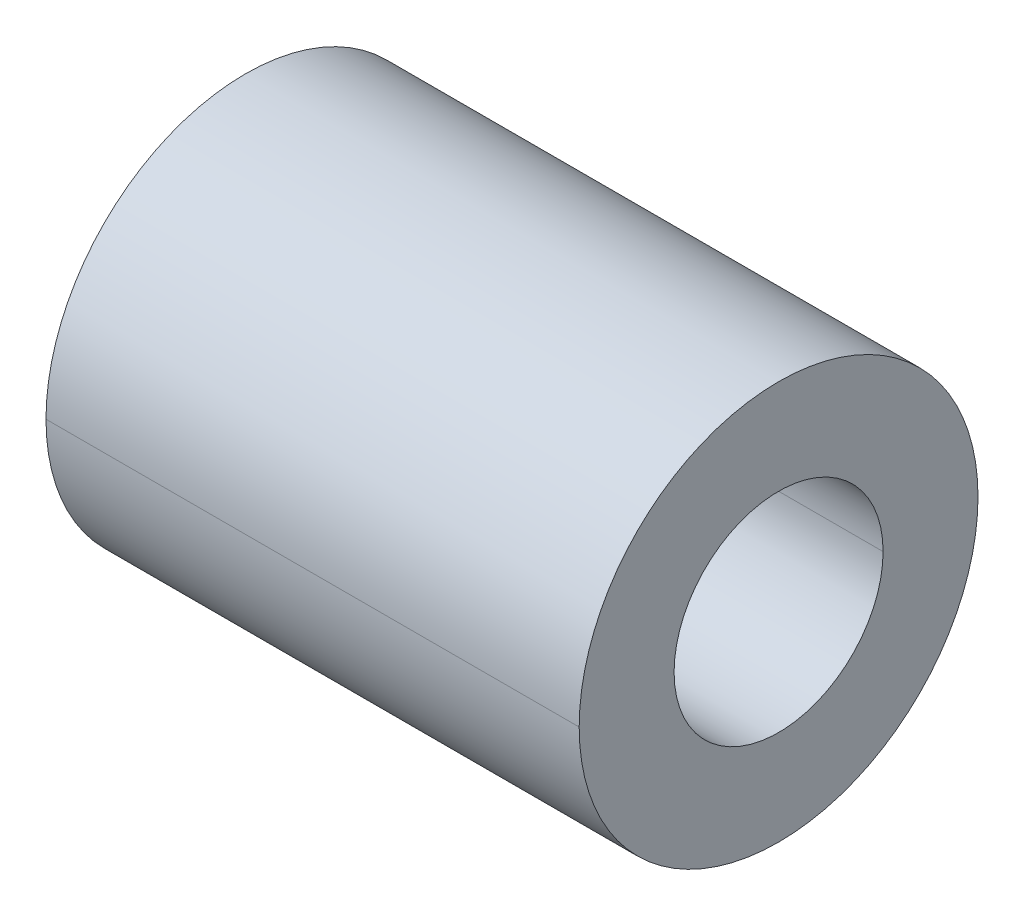
ISO-10303-21;
HEADER;
FILE_DESCRIPTION(('STEP AP214'),'2;1');
FILE_NAME('part.step','',(''),(''),'','','');
FILE_SCHEMA(('AUTOMOTIVE_DESIGN { 1 0 10303 214 1 1 1 1 }'));
ENDSEC;
DATA;
#1=APPLICATION_CONTEXT('core data for automotive mechanical design processes');
#2=APPLICATION_PROTOCOL_DEFINITION('international standard','automotive_design',2000,#1);
#3=PRODUCT_CONTEXT('',#1,'mechanical');
#4=PRODUCT('Part','Part','',(#3));
#5=PRODUCT_RELATED_PRODUCT_CATEGORY('part','',(#4));
#6=PRODUCT_DEFINITION_FORMATION('','',#4);
#7=PRODUCT_DEFINITION_CONTEXT('part definition',#1,'design');
#8=PRODUCT_DEFINITION('design','',#6,#7);
#9=PRODUCT_DEFINITION_SHAPE('','',#8);
#10=(LENGTH_UNIT() NAMED_UNIT(*) SI_UNIT(.MILLI.,.METRE.));
#11=(NAMED_UNIT(*) PLANE_ANGLE_UNIT() SI_UNIT($,.RADIAN.));
#12=(NAMED_UNIT(*) SI_UNIT($,.STERADIAN.) SOLID_ANGLE_UNIT());
#13=UNCERTAINTY_MEASURE_WITH_UNIT(LENGTH_MEASURE(1.E-05),#10,'distance_accuracy_value','');
#14=(GEOMETRIC_REPRESENTATION_CONTEXT(3) GLOBAL_UNCERTAINTY_ASSIGNED_CONTEXT((#13)) GLOBAL_UNIT_ASSIGNED_CONTEXT((#10,
#11,#12)) REPRESENTATION_CONTEXT('',''));
#15=CARTESIAN_POINT('',(0.,0.,0.));
#16=DIRECTION('',(0.,0.,1.));
#17=DIRECTION('',(1.,0.,0.));
#18=AXIS2_PLACEMENT_3D('',#15,#16,#17);
#19=CARTESIAN_POINT('',(6.35000000000064,1.38777878078145E-13,0.));
#20=DIRECTION('',(-1.,0.,0.));
#21=DIRECTION('',(0.,0.,1.));
#22=AXIS2_PLACEMENT_3D('',#19,#20,#21);
#23=CYLINDRICAL_SURFACE('',#22,2.4892);
#24=DIRECTION('',(-1.,0.,0.));
#25=VECTOR('',#24,1.);
#26=CARTESIAN_POINT('',(6.35000000000064,1.37010041794716E-13,-2.48920000000005));
#27=LINE('',#26,#25);
#28=CARTESIAN_POINT('',(6.35000000000064,1.38612206171029E-13,-2.48920000000005));
#29=VERTEX_POINT('',#28);
#30=CARTESIAN_POINT('',(-6.34999999999963,1.38612206171027E-13,-2.48919999999994));
#31=VERTEX_POINT('',#30);
#32=EDGE_CURVE('E85',#29,#31,#27,.T.);
#33=ORIENTED_EDGE('',*,*,#32,.F.);
#34=CARTESIAN_POINT('',(6.35000000000064,1.38777878078145E-13,0.));
#35=DIRECTION('',(1.,0.,0.));
#36=DIRECTION('',(0.,0.,-1.));
#37=AXIS2_PLACEMENT_3D('',#34,#35,#36);
#38=CIRCLE('',#37,2.4892);
#39=CARTESIAN_POINT('',(6.35000000000064,1.4245271781913E-13,2.48919999999994));
#40=VERTEX_POINT('',#39);
#41=EDGE_CURVE('E80',#29,#40,#38,.T.);
#42=ORIENTED_EDGE('',*,*,#41,.T.);
#43=DIRECTION('',(-1.,0.,0.));
#44=VECTOR('',#43,1.);
#45=CARTESIAN_POINT('',(6.35000000000064,1.40850553442817E-13,2.48919999999994));
#46=LINE('',#45,#44);
#47=CARTESIAN_POINT('',(-6.34999999999963,1.42452717819134E-13,2.48920000000005));
#48=VERTEX_POINT('',#47);
#49=EDGE_CURVE('E82',#40,#48,#46,.T.);
#50=ORIENTED_EDGE('',*,*,#49,.T.);
#51=CARTESIAN_POINT('',(-6.34999999999963,0.,0.));
#52=DIRECTION('',(1.,0.,0.));
#53=DIRECTION('',(0.,0.,-1.));
#54=AXIS2_PLACEMENT_3D('',#51,#52,#53);
#55=CIRCLE('',#54,2.4892);
#56=EDGE_CURVE('E11',#31,#48,#55,.T.);
#57=ORIENTED_EDGE('',*,*,#56,.F.);
#58=EDGE_LOOP('',(#33,#42,#50,#57));
#59=FACE_BOUND('',#58,.T.);
#60=ADVANCED_FACE('F16',(#59),#23,.F.);
#61=CARTESIAN_POINT('',(6.35000000000064,1.38777878078145E-13,0.));
#62=DIRECTION('',(-1.,0.,0.));
#63=DIRECTION('',(0.,0.,1.));
#64=AXIS2_PLACEMENT_3D('',#61,#62,#63);
#65=CYLINDRICAL_SURFACE('',#64,4.7498);
#66=DIRECTION('',(-1.,0.,0.));
#67=VECTOR('',#66,1.);
#68=CARTESIAN_POINT('',(6.35000000000064,1.3540455782303E-13,-4.7498));
#69=LINE('',#68,#67);
#70=CARTESIAN_POINT('',(6.35000000000064,1.37006722199343E-13,-4.74980000000006));
#71=VERTEX_POINT('',#70);
#72=CARTESIAN_POINT('',(-6.34999999999963,1.37006722199342E-13,-4.7498));
#73=VERTEX_POINT('',#72);
#74=EDGE_CURVE('E115',#71,#73,#69,.T.);
#75=ORIENTED_EDGE('',*,*,#74,.F.);
#76=CARTESIAN_POINT('',(6.35000000000064,1.38777878078145E-13,0.));
#77=DIRECTION('',(1.,0.,0.));
#78=DIRECTION('',(0.,0.,-1.));
#79=AXIS2_PLACEMENT_3D('',#76,#77,#78);
#80=CIRCLE('',#79,4.7498);
#81=CARTESIAN_POINT('',(6.35000000000064,1.44335045446231E-13,4.7498));
#82=VERTEX_POINT('',#81);
#83=EDGE_CURVE('E53',#82,#71,#80,.T.);
#84=ORIENTED_EDGE('',*,*,#83,.F.);
#85=DIRECTION('',(-1.,0.,0.));
#86=VECTOR('',#85,1.);
#87=CARTESIAN_POINT('',(6.35000000000064,1.42732881069918E-13,4.74979999999994));
#88=LINE('',#87,#86);
#89=CARTESIAN_POINT('',(-6.34999999999964,1.44335045446233E-13,4.74980000000006));
#90=VERTEX_POINT('',#89);
#91=EDGE_CURVE('E108',#82,#90,#88,.T.);
#92=ORIENTED_EDGE('',*,*,#91,.T.);
#93=CARTESIAN_POINT('',(-6.34999999999963,0.,0.));
#94=DIRECTION('',(1.,0.,0.));
#95=DIRECTION('',(0.,0.,-1.));
#96=AXIS2_PLACEMENT_3D('',#93,#94,#95);
#97=CIRCLE('',#96,4.7498);
#98=EDGE_CURVE('E26',#90,#73,#97,.T.);
#99=ORIENTED_EDGE('',*,*,#98,.T.);
#100=EDGE_LOOP('',(#75,#84,#92,#99));
#101=FACE_BOUND('',#100,.T.);
#102=ADVANCED_FACE('F18',(#101),#65,.T.);
#103=CARTESIAN_POINT('',(-6.34999999999963,0.,0.));
#104=DIRECTION('',(1.,0.,0.));
#105=DIRECTION('',(0.,0.,-1.));
#106=AXIS2_PLACEMENT_3D('',#103,#104,#105);
#107=PLANE('',#106);
#108=CARTESIAN_POINT('',(-6.34999999999963,0.,0.));
#109=DIRECTION('',(1.,0.,0.));
#110=DIRECTION('',(0.,0.,-1.));
#111=AXIS2_PLACEMENT_3D('',#108,#109,#110);
#112=CIRCLE('',#111,2.4892);
#113=EDGE_CURVE('E94',#48,#31,#112,.T.);
#114=ORIENTED_EDGE('',*,*,#113,.T.);
#115=ORIENTED_EDGE('',*,*,#56,.T.);
#116=EDGE_LOOP('',(#114,#115));
#117=FACE_BOUND('',#116,.T.);
#118=ORIENTED_EDGE('',*,*,#98,.F.);
#119=CARTESIAN_POINT('',(-6.34999999999963,0.,0.));
#120=DIRECTION('',(1.,0.,0.));
#121=DIRECTION('',(0.,0.,-1.));
#122=AXIS2_PLACEMENT_3D('',#119,#120,#121);
#123=CIRCLE('',#122,4.7498);
#124=EDGE_CURVE('E111',#73,#90,#123,.T.);
#125=ORIENTED_EDGE('',*,*,#124,.F.);
#126=EDGE_LOOP('',(#118,#125));
#127=FACE_BOUND('',#126,.T.);
#128=ADVANCED_FACE('F129',(#117,#127),#107,.F.);
#129=CARTESIAN_POINT('',(6.35000000000064,1.38777878078145E-13,0.));
#130=DIRECTION('',(1.,0.,0.));
#131=DIRECTION('',(0.,0.,-1.));
#132=AXIS2_PLACEMENT_3D('',#129,#130,#131);
#133=PLANE('',#132);
#134=CARTESIAN_POINT('',(6.35000000000064,1.38777878078145E-13,0.));
#135=DIRECTION('',(1.,0.,0.));
#136=DIRECTION('',(0.,0.,-1.));
#137=AXIS2_PLACEMENT_3D('',#134,#135,#136);
#138=CIRCLE('',#137,2.4892);
#139=EDGE_CURVE('E93',#40,#29,#138,.T.);
#140=ORIENTED_EDGE('',*,*,#139,.F.);
#141=ORIENTED_EDGE('',*,*,#41,.F.);
#142=EDGE_LOOP('',(#140,#141));
#143=FACE_BOUND('',#142,.T.);
#144=ORIENTED_EDGE('',*,*,#83,.T.);
#145=CARTESIAN_POINT('',(6.35000000000064,1.38777878078145E-13,0.));
#146=DIRECTION('',(1.,0.,0.));
#147=DIRECTION('',(0.,0.,-1.));
#148=AXIS2_PLACEMENT_3D('',#145,#146,#147);
#149=CIRCLE('',#148,4.7498);
#150=EDGE_CURVE('E96',#71,#82,#149,.T.);
#151=ORIENTED_EDGE('',*,*,#150,.T.);
#152=EDGE_LOOP('',(#144,#151));
#153=FACE_BOUND('',#152,.T.);
#154=ADVANCED_FACE('F98',(#143,#153),#133,.T.);
#155=CARTESIAN_POINT('',(6.35000000000064,1.38777878078145E-13,0.));
#156=DIRECTION('',(-1.,0.,0.));
#157=DIRECTION('',(0.,0.,1.));
#158=AXIS2_PLACEMENT_3D('',#155,#156,#157);
#159=CYLINDRICAL_SURFACE('',#158,4.7498);
#160=ORIENTED_EDGE('',*,*,#150,.F.);
#161=ORIENTED_EDGE('',*,*,#74,.T.);
#162=ORIENTED_EDGE('',*,*,#124,.T.);
#163=ORIENTED_EDGE('',*,*,#91,.F.);
#164=EDGE_LOOP('',(#160,#161,#162,#163));
#165=FACE_BOUND('',#164,.T.);
#166=ADVANCED_FACE('F128',(#165),#159,.T.);
#167=CARTESIAN_POINT('',(6.35000000000064,1.38777878078145E-13,0.));
#168=DIRECTION('',(-1.,0.,0.));
#169=DIRECTION('',(0.,0.,1.));
#170=AXIS2_PLACEMENT_3D('',#167,#168,#169);
#171=CYLINDRICAL_SURFACE('',#170,2.4892);
#172=ORIENTED_EDGE('',*,*,#139,.T.);
#173=ORIENTED_EDGE('',*,*,#32,.T.);
#174=ORIENTED_EDGE('',*,*,#113,.F.);
#175=ORIENTED_EDGE('',*,*,#49,.F.);
#176=EDGE_LOOP('',(#172,#173,#174,#175));
#177=FACE_BOUND('',#176,.T.);
#178=ADVANCED_FACE('F92',(#177),#171,.F.);
#179=CLOSED_SHELL('',(#60,#102,#128,#154,#166,#178));
#180=MANIFOLD_SOLID_BREP('B1',#179);
#181=ADVANCED_BREP_SHAPE_REPRESENTATION('',(#18,#180),#14);
#182=SHAPE_DEFINITION_REPRESENTATION(#9,#181);
ENDSEC;
END-ISO-10303-21;
